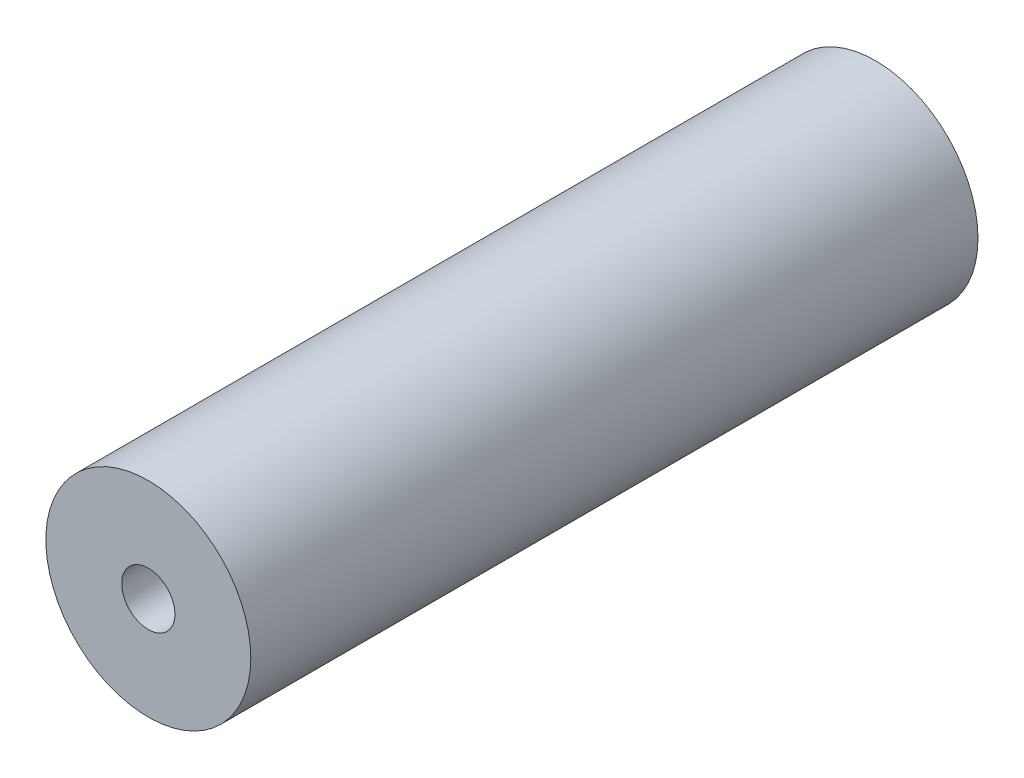
ISO-10303-21;
HEADER;
FILE_DESCRIPTION(('STEP AP214'),'2;1');
FILE_NAME('part.step','',(''),(''),'','','');
FILE_SCHEMA(('AUTOMOTIVE_DESIGN { 1 0 10303 214 1 1 1 1 }'));
ENDSEC;
DATA;
#1=APPLICATION_CONTEXT('core data for automotive mechanical design processes');
#2=APPLICATION_PROTOCOL_DEFINITION('international standard','automotive_design',2000,#1);
#3=PRODUCT_CONTEXT('',#1,'mechanical');
#4=PRODUCT('Part','Part','',(#3));
#5=PRODUCT_RELATED_PRODUCT_CATEGORY('part','',(#4));
#6=PRODUCT_DEFINITION_FORMATION('','',#4);
#7=PRODUCT_DEFINITION_CONTEXT('part definition',#1,'design');
#8=PRODUCT_DEFINITION('design','',#6,#7);
#9=PRODUCT_DEFINITION_SHAPE('','',#8);
#10=(LENGTH_UNIT() NAMED_UNIT(*) SI_UNIT(.MILLI.,.METRE.));
#11=(NAMED_UNIT(*) PLANE_ANGLE_UNIT() SI_UNIT($,.RADIAN.));
#12=(NAMED_UNIT(*) SI_UNIT($,.STERADIAN.) SOLID_ANGLE_UNIT());
#13=UNCERTAINTY_MEASURE_WITH_UNIT(LENGTH_MEASURE(1.E-05),#10,'distance_accuracy_value','');
#14=(GEOMETRIC_REPRESENTATION_CONTEXT(3) GLOBAL_UNCERTAINTY_ASSIGNED_CONTEXT((#13)) GLOBAL_UNIT_ASSIGNED_CONTEXT((#10,
#11,#12)) REPRESENTATION_CONTEXT('',''));
#15=CARTESIAN_POINT('',(0.,0.,0.));
#16=DIRECTION('',(0.,0.,1.));
#17=DIRECTION('',(1.,0.,0.));
#18=AXIS2_PLACEMENT_3D('',#15,#16,#17);
#19=CARTESIAN_POINT('',(0.,0.,110.));
#20=DIRECTION('',(0.,0.,1.));
#21=DIRECTION('',(1.,0.,0.));
#22=AXIS2_PLACEMENT_3D('',#19,#20,#21);
#23=PLANE('',#22);
#24=CARTESIAN_POINT('',(0.,0.,110.));
#25=DIRECTION('',(0.,0.,1.));
#26=DIRECTION('',(1.,0.,0.));
#27=AXIS2_PLACEMENT_3D('',#24,#25,#26);
#28=CIRCLE('',#27,15.5);
#29=CARTESIAN_POINT('',(15.5,0.,110.));
#30=VERTEX_POINT('',#29);
#31=EDGE_CURVE('E10',#30,#30,#28,.T.);
#32=ORIENTED_EDGE('',*,*,#31,.T.);
#33=EDGE_LOOP('',(#32));
#34=FACE_BOUND('',#33,.T.);
#35=CARTESIAN_POINT('',(0.,0.,110.));
#36=DIRECTION('',(0.,0.,1.));
#37=DIRECTION('',(1.,0.,0.));
#38=AXIS2_PLACEMENT_3D('',#35,#36,#37);
#39=CIRCLE('',#38,4.025);
#40=CARTESIAN_POINT('',(4.025,0.,110.));
#41=VERTEX_POINT('',#40);
#42=EDGE_CURVE('E44',#41,#41,#39,.T.);
#43=ORIENTED_EDGE('',*,*,#42,.F.);
#44=EDGE_LOOP('',(#43));
#45=FACE_BOUND('',#44,.T.);
#46=ADVANCED_FACE('F33',(#34,#45),#23,.T.);
#47=CARTESIAN_POINT('',(0.,0.,0.));
#48=DIRECTION('',(0.,0.,1.));
#49=DIRECTION('',(1.,0.,0.));
#50=AXIS2_PLACEMENT_3D('',#47,#48,#49);
#51=PLANE('',#50);
#52=CARTESIAN_POINT('',(0.,0.,0.));
#53=DIRECTION('',(0.,0.,1.));
#54=DIRECTION('',(1.,0.,0.));
#55=AXIS2_PLACEMENT_3D('',#52,#53,#54);
#56=CIRCLE('',#55,15.5);
#57=CARTESIAN_POINT('',(15.5,0.,0.));
#58=VERTEX_POINT('',#57);
#59=EDGE_CURVE('E37',#58,#58,#56,.T.);
#60=ORIENTED_EDGE('',*,*,#59,.F.);
#61=EDGE_LOOP('',(#60));
#62=FACE_BOUND('',#61,.T.);
#63=CARTESIAN_POINT('',(0.,0.,0.));
#64=DIRECTION('',(0.,0.,1.));
#65=DIRECTION('',(1.,0.,0.));
#66=AXIS2_PLACEMENT_3D('',#63,#64,#65);
#67=CIRCLE('',#66,4.025);
#68=CARTESIAN_POINT('',(4.025,0.,0.));
#69=VERTEX_POINT('',#68);
#70=EDGE_CURVE('E46',#69,#69,#67,.T.);
#71=ORIENTED_EDGE('',*,*,#70,.T.);
#72=EDGE_LOOP('',(#71));
#73=FACE_BOUND('',#72,.T.);
#74=ADVANCED_FACE('F56',(#62,#73),#51,.F.);
#75=CARTESIAN_POINT('',(0.,0.,110.));
#76=DIRECTION('',(0.,0.,-1.));
#77=DIRECTION('',(-1.,0.,0.));
#78=AXIS2_PLACEMENT_3D('',#75,#76,#77);
#79=CYLINDRICAL_SURFACE('',#78,15.5);
#80=ORIENTED_EDGE('',*,*,#31,.F.);
#81=EDGE_LOOP('',(#80));
#82=FACE_BOUND('',#81,.T.);
#83=ORIENTED_EDGE('',*,*,#59,.T.);
#84=EDGE_LOOP('',(#83));
#85=FACE_BOUND('',#84,.T.);
#86=ADVANCED_FACE('F35',(#82,#85),#79,.T.);
#87=CARTESIAN_POINT('',(0.,0.,110.));
#88=DIRECTION('',(0.,0.,-1.));
#89=DIRECTION('',(-1.,0.,0.));
#90=AXIS2_PLACEMENT_3D('',#87,#88,#89);
#91=CYLINDRICAL_SURFACE('',#90,4.025);
#92=ORIENTED_EDGE('',*,*,#42,.T.);
#93=EDGE_LOOP('',(#92));
#94=FACE_BOUND('',#93,.T.);
#95=ORIENTED_EDGE('',*,*,#70,.F.);
#96=EDGE_LOOP('',(#95));
#97=FACE_BOUND('',#96,.T.);
#98=ADVANCED_FACE('F52',(#94,#97),#91,.F.);
#99=CLOSED_SHELL('',(#46,#74,#86,#98));
#100=MANIFOLD_SOLID_BREP('B2',#99);
#101=ADVANCED_BREP_SHAPE_REPRESENTATION('',(#18,#100),#14);
#102=SHAPE_DEFINITION_REPRESENTATION(#9,#101);
ENDSEC;
END-ISO-10303-21;
